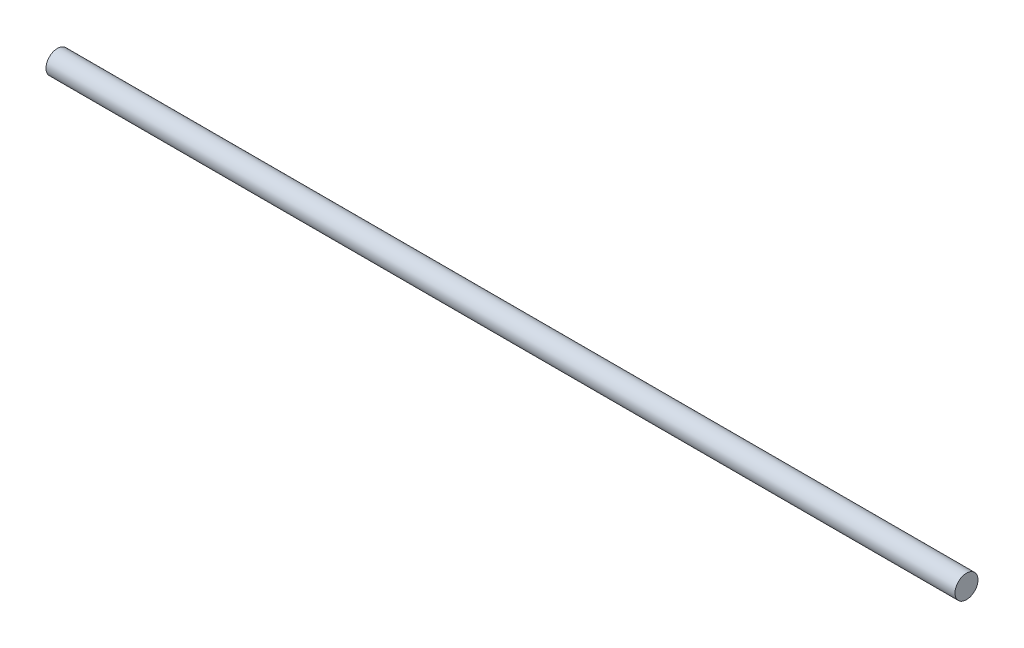
ISO-10303-21;
HEADER;
FILE_DESCRIPTION(('STEP AP214'),'2;1');
FILE_NAME('part.step','',(''),(''),'','','');
FILE_SCHEMA(('AUTOMOTIVE_DESIGN { 1 0 10303 214 1 1 1 1 }'));
ENDSEC;
DATA;
#1=APPLICATION_CONTEXT('core data for automotive mechanical design processes');
#2=APPLICATION_PROTOCOL_DEFINITION('international standard','automotive_design',2000,#1);
#3=PRODUCT_CONTEXT('',#1,'mechanical');
#4=PRODUCT('Part','Part','',(#3));
#5=PRODUCT_RELATED_PRODUCT_CATEGORY('part','',(#4));
#6=PRODUCT_DEFINITION_FORMATION('','',#4);
#7=PRODUCT_DEFINITION_CONTEXT('part definition',#1,'design');
#8=PRODUCT_DEFINITION('design','',#6,#7);
#9=PRODUCT_DEFINITION_SHAPE('','',#8);
#10=(LENGTH_UNIT() NAMED_UNIT(*) SI_UNIT(.MILLI.,.METRE.));
#11=(NAMED_UNIT(*) PLANE_ANGLE_UNIT() SI_UNIT($,.RADIAN.));
#12=(NAMED_UNIT(*) SI_UNIT($,.STERADIAN.) SOLID_ANGLE_UNIT());
#13=UNCERTAINTY_MEASURE_WITH_UNIT(LENGTH_MEASURE(1.E-05),#10,'distance_accuracy_value','');
#14=(GEOMETRIC_REPRESENTATION_CONTEXT(3) GLOBAL_UNCERTAINTY_ASSIGNED_CONTEXT((#13)) GLOBAL_UNIT_ASSIGNED_CONTEXT((#10,
#11,#12)) REPRESENTATION_CONTEXT('',''));
#15=CARTESIAN_POINT('',(0.,0.,0.));
#16=DIRECTION('',(0.,0.,1.));
#17=DIRECTION('',(1.,0.,0.));
#18=AXIS2_PLACEMENT_3D('',#15,#16,#17);
#19=CARTESIAN_POINT('',(501.3,0.,0.));
#20=DIRECTION('',(-1.,0.,0.));
#21=DIRECTION('',(0.,0.,1.));
#22=AXIS2_PLACEMENT_3D('',#19,#20,#21);
#23=CYLINDRICAL_SURFACE('',#22,6.35);
#24=CARTESIAN_POINT('',(501.3,0.,0.));
#25=DIRECTION('',(1.,0.,0.));
#26=DIRECTION('',(0.,0.,-1.));
#27=AXIS2_PLACEMENT_3D('',#24,#25,#26);
#28=CIRCLE('',#27,6.35);
#29=CARTESIAN_POINT('',(501.3,0.,-6.35));
#30=VERTEX_POINT('',#29);
#31=EDGE_CURVE('E10',#30,#30,#28,.T.);
#32=ORIENTED_EDGE('',*,*,#31,.F.);
#33=EDGE_LOOP('',(#32));
#34=FACE_BOUND('',#33,.T.);
#35=CARTESIAN_POINT('',(0.,0.,0.));
#36=DIRECTION('',(1.,0.,0.));
#37=DIRECTION('',(0.,0.,-1.));
#38=AXIS2_PLACEMENT_3D('',#35,#36,#37);
#39=CIRCLE('',#38,6.35);
#40=CARTESIAN_POINT('',(0.,0.,-6.35));
#41=VERTEX_POINT('',#40);
#42=EDGE_CURVE('E34',#41,#41,#39,.T.);
#43=ORIENTED_EDGE('',*,*,#42,.T.);
#44=EDGE_LOOP('',(#43));
#45=FACE_BOUND('',#44,.T.);
#46=ADVANCED_FACE('F31',(#34,#45),#23,.T.);
#47=CARTESIAN_POINT('',(501.3,0.,0.));
#48=DIRECTION('',(1.,0.,0.));
#49=DIRECTION('',(0.,0.,-1.));
#50=AXIS2_PLACEMENT_3D('',#47,#48,#49);
#51=PLANE('',#50);
#52=ORIENTED_EDGE('',*,*,#31,.T.);
#53=EDGE_LOOP('',(#52));
#54=FACE_BOUND('',#53,.T.);
#55=ADVANCED_FACE('F46',(#54),#51,.T.);
#56=CARTESIAN_POINT('',(0.,0.,0.));
#57=DIRECTION('',(1.,0.,0.));
#58=DIRECTION('',(0.,0.,-1.));
#59=AXIS2_PLACEMENT_3D('',#56,#57,#58);
#60=PLANE('',#59);
#61=ORIENTED_EDGE('',*,*,#42,.F.);
#62=EDGE_LOOP('',(#61));
#63=FACE_BOUND('',#62,.T.);
#64=ADVANCED_FACE('F44',(#63),#60,.F.);
#65=CLOSED_SHELL('',(#46,#55,#64));
#66=MANIFOLD_SOLID_BREP('B2',#65);
#67=ADVANCED_BREP_SHAPE_REPRESENTATION('',(#18,#66),#14);
#68=SHAPE_DEFINITION_REPRESENTATION(#9,#67);
ENDSEC;
END-ISO-10303-21;
